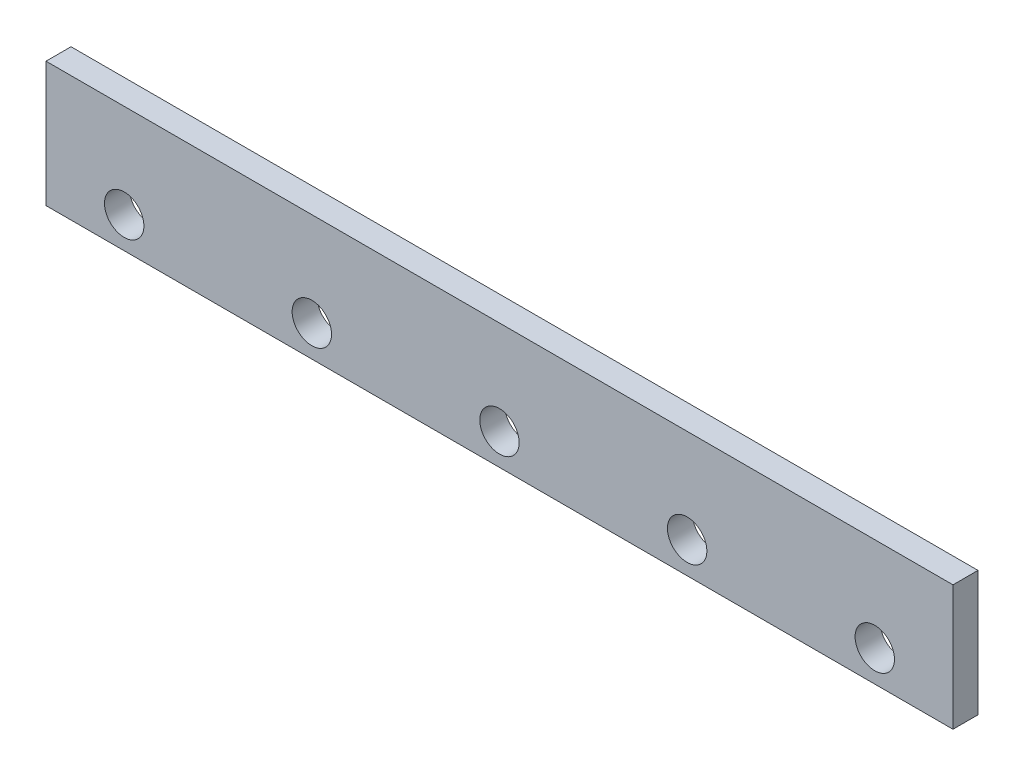
ISO-10303-21;
HEADER;
FILE_DESCRIPTION(('STEP AP214'),'2;1');
FILE_NAME('part.step','',(''),(''),'','','');
FILE_SCHEMA(('AUTOMOTIVE_DESIGN { 1 0 10303 214 1 1 1 1 }'));
ENDSEC;
DATA;
#1=APPLICATION_CONTEXT('core data for automotive mechanical design processes');
#2=APPLICATION_PROTOCOL_DEFINITION('international standard','automotive_design',2000,#1);
#3=PRODUCT_CONTEXT('',#1,'mechanical');
#4=PRODUCT('Part','Part','',(#3));
#5=PRODUCT_RELATED_PRODUCT_CATEGORY('part','',(#4));
#6=PRODUCT_DEFINITION_FORMATION('','',#4);
#7=PRODUCT_DEFINITION_CONTEXT('part definition',#1,'design');
#8=PRODUCT_DEFINITION('design','',#6,#7);
#9=PRODUCT_DEFINITION_SHAPE('','',#8);
#10=(LENGTH_UNIT() NAMED_UNIT(*) SI_UNIT(.MILLI.,.METRE.));
#11=(NAMED_UNIT(*) PLANE_ANGLE_UNIT() SI_UNIT($,.RADIAN.));
#12=(NAMED_UNIT(*) SI_UNIT($,.STERADIAN.) SOLID_ANGLE_UNIT());
#13=UNCERTAINTY_MEASURE_WITH_UNIT(LENGTH_MEASURE(1.E-05),#10,'distance_accuracy_value','');
#14=(GEOMETRIC_REPRESENTATION_CONTEXT(3) GLOBAL_UNCERTAINTY_ASSIGNED_CONTEXT((#13)) GLOBAL_UNIT_ASSIGNED_CONTEXT((#10,
#11,#12)) REPRESENTATION_CONTEXT('',''));
#15=CARTESIAN_POINT('',(0.,0.,0.));
#16=DIRECTION('',(0.,0.,1.));
#17=DIRECTION('',(1.,0.,0.));
#18=AXIS2_PLACEMENT_3D('',#15,#16,#17);
#19=CARTESIAN_POINT('',(0.,0.,16.));
#20=DIRECTION('',(0.,0.,-1.));
#21=DIRECTION('',(-1.,0.,0.));
#22=AXIS2_PLACEMENT_3D('',#19,#20,#21);
#23=PLANE('',#22);
#24=CARTESIAN_POINT('',(410.,20.,16.));
#25=DIRECTION('',(0.,0.,1.));
#26=DIRECTION('',(1.,0.,0.));
#27=AXIS2_PLACEMENT_3D('',#24,#25,#26);
#28=CIRCLE('',#27,12.6);
#29=CARTESIAN_POINT('',(422.6,20.,16.));
#30=VERTEX_POINT('',#29);
#31=EDGE_CURVE('E127',#30,#30,#28,.T.);
#32=ORIENTED_EDGE('',*,*,#31,.F.);
#33=EDGE_LOOP('',(#32));
#34=FACE_BOUND('',#33,.T.);
#35=CARTESIAN_POINT('',(170.,20.,16.));
#36=DIRECTION('',(0.,0.,1.));
#37=DIRECTION('',(1.,0.,0.));
#38=AXIS2_PLACEMENT_3D('',#35,#36,#37);
#39=CIRCLE('',#38,12.6);
#40=CARTESIAN_POINT('',(182.6,20.,16.));
#41=VERTEX_POINT('',#40);
#42=EDGE_CURVE('E115',#41,#41,#39,.T.);
#43=ORIENTED_EDGE('',*,*,#42,.F.);
#44=EDGE_LOOP('',(#43));
#45=FACE_BOUND('',#44,.T.);
#46=DIRECTION('',(0.,-1.,0.));
#47=VECTOR('',#46,1.);
#48=CARTESIAN_POINT('',(0.,0.,16.));
#49=LINE('',#48,#47);
#50=CARTESIAN_POINT('',(0.,80.,16.));
#51=VERTEX_POINT('',#50);
#52=CARTESIAN_POINT('',(0.,0.,16.));
#53=VERTEX_POINT('',#52);
#54=EDGE_CURVE('E85',#51,#53,#49,.T.);
#55=ORIENTED_EDGE('',*,*,#54,.T.);
#56=DIRECTION('',(1.,0.,0.));
#57=VECTOR('',#56,1.);
#58=CARTESIAN_POINT('',(0.,0.,16.));
#59=LINE('',#58,#57);
#60=CARTESIAN_POINT('',(580.,0.,16.));
#61=VERTEX_POINT('',#60);
#62=EDGE_CURVE('E80',#53,#61,#59,.T.);
#63=ORIENTED_EDGE('',*,*,#62,.T.);
#64=DIRECTION('',(0.,1.,0.));
#65=VECTOR('',#64,1.);
#66=CARTESIAN_POINT('',(580.,0.,16.));
#67=LINE('',#66,#65);
#68=CARTESIAN_POINT('',(580.,80.,16.));
#69=VERTEX_POINT('',#68);
#70=EDGE_CURVE('E83',#61,#69,#67,.T.);
#71=ORIENTED_EDGE('',*,*,#70,.T.);
#72=DIRECTION('',(-1.,0.,0.));
#73=VECTOR('',#72,1.);
#74=CARTESIAN_POINT('',(0.,80.,16.));
#75=LINE('',#74,#73);
#76=EDGE_CURVE('E50',#69,#51,#75,.T.);
#77=ORIENTED_EDGE('',*,*,#76,.T.);
#78=EDGE_LOOP('',(#55,#63,#71,#77));
#79=FACE_BOUND('',#78,.T.);
#80=CARTESIAN_POINT('',(50.,20.,16.));
#81=DIRECTION('',(0.,0.,1.));
#82=DIRECTION('',(1.,0.,0.));
#83=AXIS2_PLACEMENT_3D('',#80,#81,#82);
#84=CIRCLE('',#83,12.6);
#85=CARTESIAN_POINT('',(62.6,20.,16.));
#86=VERTEX_POINT('',#85);
#87=EDGE_CURVE('E100',#86,#86,#84,.T.);
#88=ORIENTED_EDGE('',*,*,#87,.F.);
#89=EDGE_LOOP('',(#88));
#90=FACE_BOUND('',#89,.T.);
#91=CARTESIAN_POINT('',(290.,20.,16.));
#92=DIRECTION('',(0.,0.,1.));
#93=DIRECTION('',(1.,0.,0.));
#94=AXIS2_PLACEMENT_3D('',#91,#92,#93);
#95=CIRCLE('',#94,12.6);
#96=CARTESIAN_POINT('',(302.6,20.,16.));
#97=VERTEX_POINT('',#96);
#98=EDGE_CURVE('E121',#97,#97,#95,.T.);
#99=ORIENTED_EDGE('',*,*,#98,.F.);
#100=EDGE_LOOP('',(#99));
#101=FACE_BOUND('',#100,.T.);
#102=CARTESIAN_POINT('',(530.,20.,16.));
#103=DIRECTION('',(0.,0.,1.));
#104=DIRECTION('',(1.,0.,0.));
#105=AXIS2_PLACEMENT_3D('',#102,#103,#104);
#106=CIRCLE('',#105,12.5999999999999);
#107=CARTESIAN_POINT('',(542.6,20.,16.));
#108=VERTEX_POINT('',#107);
#109=EDGE_CURVE('E133',#108,#108,#106,.T.);
#110=ORIENTED_EDGE('',*,*,#109,.F.);
#111=EDGE_LOOP('',(#110));
#112=FACE_BOUND('',#111,.T.);
#113=ADVANCED_FACE('F33',(#34,#45,#79,#90,#101,#112),#23,.F.);
#114=CARTESIAN_POINT('',(0.,0.,0.));
#115=DIRECTION('',(0.,0.,-1.));
#116=DIRECTION('',(-1.,0.,0.));
#117=AXIS2_PLACEMENT_3D('',#114,#115,#116);
#118=PLANE('',#117);
#119=CARTESIAN_POINT('',(410.,20.,0.));
#120=DIRECTION('',(0.,0.,1.));
#121=DIRECTION('',(1.,0.,0.));
#122=AXIS2_PLACEMENT_3D('',#119,#120,#121);
#123=CIRCLE('',#122,12.6);
#124=CARTESIAN_POINT('',(422.6,20.,0.));
#125=VERTEX_POINT('',#124);
#126=EDGE_CURVE('E130',#125,#125,#123,.T.);
#127=ORIENTED_EDGE('',*,*,#126,.T.);
#128=EDGE_LOOP('',(#127));
#129=FACE_BOUND('',#128,.T.);
#130=CARTESIAN_POINT('',(170.,20.,0.));
#131=DIRECTION('',(0.,0.,1.));
#132=DIRECTION('',(1.,0.,0.));
#133=AXIS2_PLACEMENT_3D('',#130,#131,#132);
#134=CIRCLE('',#133,12.6);
#135=CARTESIAN_POINT('',(182.6,20.,0.));
#136=VERTEX_POINT('',#135);
#137=EDGE_CURVE('E118',#136,#136,#134,.T.);
#138=ORIENTED_EDGE('',*,*,#137,.T.);
#139=EDGE_LOOP('',(#138));
#140=FACE_BOUND('',#139,.T.);
#141=DIRECTION('',(0.,-1.,0.));
#142=VECTOR('',#141,1.);
#143=CARTESIAN_POINT('',(0.,0.,0.));
#144=LINE('',#143,#142);
#145=CARTESIAN_POINT('',(0.,80.,0.));
#146=VERTEX_POINT('',#145);
#147=CARTESIAN_POINT('',(0.,0.,0.));
#148=VERTEX_POINT('',#147);
#149=EDGE_CURVE('E97',#146,#148,#144,.T.);
#150=ORIENTED_EDGE('',*,*,#149,.F.);
#151=DIRECTION('',(-1.,0.,0.));
#152=VECTOR('',#151,1.);
#153=CARTESIAN_POINT('',(0.,80.,0.));
#154=LINE('',#153,#152);
#155=CARTESIAN_POINT('',(580.,80.,0.));
#156=VERTEX_POINT('',#155);
#157=EDGE_CURVE('E73',#156,#146,#154,.T.);
#158=ORIENTED_EDGE('',*,*,#157,.F.);
#159=DIRECTION('',(0.,1.,0.));
#160=VECTOR('',#159,1.);
#161=CARTESIAN_POINT('',(580.,0.,0.));
#162=LINE('',#161,#160);
#163=CARTESIAN_POINT('',(580.,0.,0.));
#164=VERTEX_POINT('',#163);
#165=EDGE_CURVE('E67',#164,#156,#162,.T.);
#166=ORIENTED_EDGE('',*,*,#165,.F.);
#167=DIRECTION('',(1.,0.,0.));
#168=VECTOR('',#167,1.);
#169=CARTESIAN_POINT('',(0.,0.,0.));
#170=LINE('',#169,#168);
#171=EDGE_CURVE('E89',#148,#164,#170,.T.);
#172=ORIENTED_EDGE('',*,*,#171,.F.);
#173=EDGE_LOOP('',(#150,#158,#166,#172));
#174=FACE_BOUND('',#173,.T.);
#175=CARTESIAN_POINT('',(50.,20.,0.));
#176=DIRECTION('',(0.,0.,1.));
#177=DIRECTION('',(1.,0.,0.));
#178=AXIS2_PLACEMENT_3D('',#175,#176,#177);
#179=CIRCLE('',#178,12.6);
#180=CARTESIAN_POINT('',(62.6,20.,0.));
#181=VERTEX_POINT('',#180);
#182=EDGE_CURVE('E112',#181,#181,#179,.T.);
#183=ORIENTED_EDGE('',*,*,#182,.T.);
#184=EDGE_LOOP('',(#183));
#185=FACE_BOUND('',#184,.T.);
#186=CARTESIAN_POINT('',(290.,20.,0.));
#187=DIRECTION('',(0.,0.,1.));
#188=DIRECTION('',(1.,0.,0.));
#189=AXIS2_PLACEMENT_3D('',#186,#187,#188);
#190=CIRCLE('',#189,12.6);
#191=CARTESIAN_POINT('',(302.6,20.,0.));
#192=VERTEX_POINT('',#191);
#193=EDGE_CURVE('E124',#192,#192,#190,.T.);
#194=ORIENTED_EDGE('',*,*,#193,.T.);
#195=EDGE_LOOP('',(#194));
#196=FACE_BOUND('',#195,.T.);
#197=CARTESIAN_POINT('',(530.,20.,0.));
#198=DIRECTION('',(0.,0.,1.));
#199=DIRECTION('',(1.,0.,0.));
#200=AXIS2_PLACEMENT_3D('',#197,#198,#199);
#201=CIRCLE('',#200,12.5999999999999);
#202=CARTESIAN_POINT('',(542.6,20.,0.));
#203=VERTEX_POINT('',#202);
#204=EDGE_CURVE('E136',#203,#203,#201,.T.);
#205=ORIENTED_EDGE('',*,*,#204,.T.);
#206=EDGE_LOOP('',(#205));
#207=FACE_BOUND('',#206,.T.);
#208=ADVANCED_FACE('F108',(#129,#140,#174,#185,#196,#207),#118,.T.);
#209=CARTESIAN_POINT('',(0.,0.,16.));
#210=DIRECTION('',(1.,0.,0.));
#211=DIRECTION('',(0.,0.,-1.));
#212=AXIS2_PLACEMENT_3D('',#209,#210,#211);
#213=PLANE('',#212);
#214=ORIENTED_EDGE('',*,*,#149,.T.);
#215=DIRECTION('',(0.,0.,-1.));
#216=VECTOR('',#215,1.);
#217=CARTESIAN_POINT('',(0.,0.,16.));
#218=LINE('',#217,#216);
#219=EDGE_CURVE('E11',#53,#148,#218,.T.);
#220=ORIENTED_EDGE('',*,*,#219,.F.);
#221=ORIENTED_EDGE('',*,*,#54,.F.);
#222=DIRECTION('',(0.,0.,-1.));
#223=VECTOR('',#222,1.);
#224=CARTESIAN_POINT('',(0.,80.,16.));
#225=LINE('',#224,#223);
#226=EDGE_CURVE('E93',#51,#146,#225,.T.);
#227=ORIENTED_EDGE('',*,*,#226,.T.);
#228=EDGE_LOOP('',(#214,#220,#221,#227));
#229=FACE_BOUND('',#228,.T.);
#230=ADVANCED_FACE('F35',(#229),#213,.F.);
#231=CARTESIAN_POINT('',(0.,0.,16.));
#232=DIRECTION('',(0.,1.,0.));
#233=DIRECTION('',(0.,0.,1.));
#234=AXIS2_PLACEMENT_3D('',#231,#232,#233);
#235=PLANE('',#234);
#236=ORIENTED_EDGE('',*,*,#171,.T.);
#237=DIRECTION('',(0.,0.,-1.));
#238=VECTOR('',#237,1.);
#239=CARTESIAN_POINT('',(580.,0.,16.));
#240=LINE('',#239,#238);
#241=EDGE_CURVE('E42',#61,#164,#240,.T.);
#242=ORIENTED_EDGE('',*,*,#241,.F.);
#243=ORIENTED_EDGE('',*,*,#62,.F.);
#244=ORIENTED_EDGE('',*,*,#219,.T.);
#245=EDGE_LOOP('',(#236,#242,#243,#244));
#246=FACE_BOUND('',#245,.T.);
#247=ADVANCED_FACE('F88',(#246),#235,.F.);
#248=CARTESIAN_POINT('',(580.,0.,16.));
#249=DIRECTION('',(-1.,0.,0.));
#250=DIRECTION('',(0.,0.,1.));
#251=AXIS2_PLACEMENT_3D('',#248,#249,#250);
#252=PLANE('',#251);
#253=ORIENTED_EDGE('',*,*,#165,.T.);
#254=DIRECTION('',(0.,0.,-1.));
#255=VECTOR('',#254,1.);
#256=CARTESIAN_POINT('',(580.,80.,16.));
#257=LINE('',#256,#255);
#258=EDGE_CURVE('E90',#69,#156,#257,.T.);
#259=ORIENTED_EDGE('',*,*,#258,.F.);
#260=ORIENTED_EDGE('',*,*,#70,.F.);
#261=ORIENTED_EDGE('',*,*,#241,.T.);
#262=EDGE_LOOP('',(#253,#259,#260,#261));
#263=FACE_BOUND('',#262,.T.);
#264=ADVANCED_FACE('F91',(#263),#252,.F.);
#265=CARTESIAN_POINT('',(0.,80.,16.));
#266=DIRECTION('',(0.,-1.,0.));
#267=DIRECTION('',(0.,0.,-1.));
#268=AXIS2_PLACEMENT_3D('',#265,#266,#267);
#269=PLANE('',#268);
#270=ORIENTED_EDGE('',*,*,#157,.T.);
#271=ORIENTED_EDGE('',*,*,#226,.F.);
#272=ORIENTED_EDGE('',*,*,#76,.F.);
#273=ORIENTED_EDGE('',*,*,#258,.T.);
#274=EDGE_LOOP('',(#270,#271,#272,#273));
#275=FACE_BOUND('',#274,.T.);
#276=ADVANCED_FACE('F105',(#275),#269,.F.);
#277=CARTESIAN_POINT('',(50.,20.,16.));
#278=DIRECTION('',(0.,0.,-1.));
#279=DIRECTION('',(-1.,0.,0.));
#280=AXIS2_PLACEMENT_3D('',#277,#278,#279);
#281=CYLINDRICAL_SURFACE('',#280,12.6);
#282=ORIENTED_EDGE('',*,*,#87,.T.);
#283=EDGE_LOOP('',(#282));
#284=FACE_BOUND('',#283,.T.);
#285=ORIENTED_EDGE('',*,*,#182,.F.);
#286=EDGE_LOOP('',(#285));
#287=FACE_BOUND('',#286,.T.);
#288=ADVANCED_FACE('F156',(#284,#287),#281,.F.);
#289=CARTESIAN_POINT('',(170.,20.,16.));
#290=DIRECTION('',(0.,0.,-1.));
#291=DIRECTION('',(-1.,0.,0.));
#292=AXIS2_PLACEMENT_3D('',#289,#290,#291);
#293=CYLINDRICAL_SURFACE('',#292,12.6);
#294=ORIENTED_EDGE('',*,*,#42,.T.);
#295=EDGE_LOOP('',(#294));
#296=FACE_BOUND('',#295,.T.);
#297=ORIENTED_EDGE('',*,*,#137,.F.);
#298=EDGE_LOOP('',(#297));
#299=FACE_BOUND('',#298,.T.);
#300=ADVANCED_FACE('F185',(#296,#299),#293,.F.);
#301=CARTESIAN_POINT('',(290.,20.,16.));
#302=DIRECTION('',(0.,0.,-1.));
#303=DIRECTION('',(-1.,0.,0.));
#304=AXIS2_PLACEMENT_3D('',#301,#302,#303);
#305=CYLINDRICAL_SURFACE('',#304,12.6);
#306=ORIENTED_EDGE('',*,*,#98,.T.);
#307=EDGE_LOOP('',(#306));
#308=FACE_BOUND('',#307,.T.);
#309=ORIENTED_EDGE('',*,*,#193,.F.);
#310=EDGE_LOOP('',(#309));
#311=FACE_BOUND('',#310,.T.);
#312=ADVANCED_FACE('F194',(#308,#311),#305,.F.);
#313=CARTESIAN_POINT('',(410.,20.,16.));
#314=DIRECTION('',(0.,0.,-1.));
#315=DIRECTION('',(-1.,0.,0.));
#316=AXIS2_PLACEMENT_3D('',#313,#314,#315);
#317=CYLINDRICAL_SURFACE('',#316,12.6);
#318=ORIENTED_EDGE('',*,*,#31,.T.);
#319=EDGE_LOOP('',(#318));
#320=FACE_BOUND('',#319,.T.);
#321=ORIENTED_EDGE('',*,*,#126,.F.);
#322=EDGE_LOOP('',(#321));
#323=FACE_BOUND('',#322,.T.);
#324=ADVANCED_FACE('F203',(#320,#323),#317,.F.);
#325=CARTESIAN_POINT('',(530.,20.,16.));
#326=DIRECTION('',(0.,0.,-1.));
#327=DIRECTION('',(-1.,0.,0.));
#328=AXIS2_PLACEMENT_3D('',#325,#326,#327);
#329=CYLINDRICAL_SURFACE('',#328,12.5999999999999);
#330=ORIENTED_EDGE('',*,*,#109,.T.);
#331=EDGE_LOOP('',(#330));
#332=FACE_BOUND('',#331,.T.);
#333=ORIENTED_EDGE('',*,*,#204,.F.);
#334=EDGE_LOOP('',(#333));
#335=FACE_BOUND('',#334,.T.);
#336=ADVANCED_FACE('F142',(#332,#335),#329,.F.);
#337=CLOSED_SHELL('',(#113,#208,#230,#247,#264,#276,#288,#300,#312,#324,#336));
#338=MANIFOLD_SOLID_BREP('B2',#337);
#339=ADVANCED_BREP_SHAPE_REPRESENTATION('',(#18,#338),#14);
#340=SHAPE_DEFINITION_REPRESENTATION(#9,#339);
ENDSEC;
END-ISO-10303-21;
